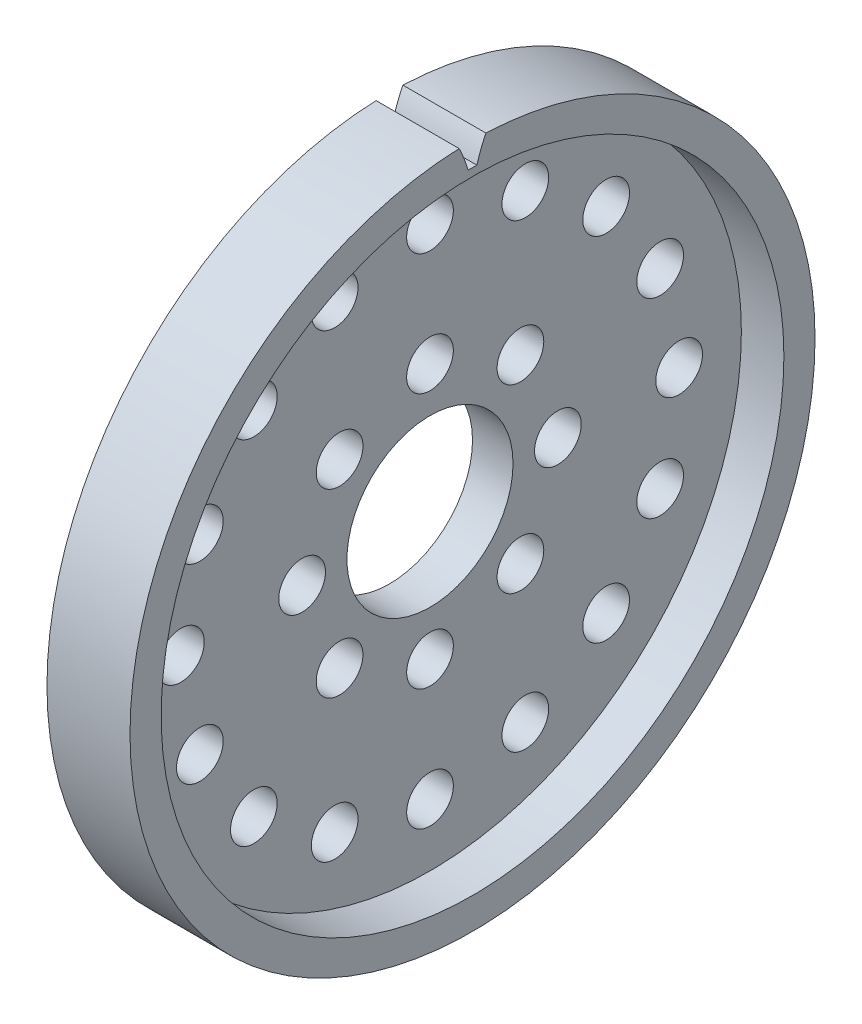
ISO-10303-21;
HEADER;
FILE_DESCRIPTION(('STEP AP214'),'2;1');
FILE_NAME('part.step','',(''),(''),'','','');
FILE_SCHEMA(('AUTOMOTIVE_DESIGN { 1 0 10303 214 1 1 1 1 }'));
ENDSEC;
DATA;
#1=APPLICATION_CONTEXT('core data for automotive mechanical design processes');
#2=APPLICATION_PROTOCOL_DEFINITION('international standard','automotive_design',2000,#1);
#3=PRODUCT_CONTEXT('',#1,'mechanical');
#4=PRODUCT('Part','Part','',(#3));
#5=PRODUCT_RELATED_PRODUCT_CATEGORY('part','',(#4));
#6=PRODUCT_DEFINITION_FORMATION('','',#4);
#7=PRODUCT_DEFINITION_CONTEXT('part definition',#1,'design');
#8=PRODUCT_DEFINITION('design','',#6,#7);
#9=PRODUCT_DEFINITION_SHAPE('','',#8);
#10=(LENGTH_UNIT() NAMED_UNIT(*) SI_UNIT(.MILLI.,.METRE.));
#11=(NAMED_UNIT(*) PLANE_ANGLE_UNIT() SI_UNIT($,.RADIAN.));
#12=(NAMED_UNIT(*) SI_UNIT($,.STERADIAN.) SOLID_ANGLE_UNIT());
#13=UNCERTAINTY_MEASURE_WITH_UNIT(LENGTH_MEASURE(1.E-05),#10,'distance_accuracy_value','');
#14=(GEOMETRIC_REPRESENTATION_CONTEXT(3) GLOBAL_UNCERTAINTY_ASSIGNED_CONTEXT((#13)) GLOBAL_UNIT_ASSIGNED_CONTEXT((#10,
#11,#12)) REPRESENTATION_CONTEXT('',''));
#15=CARTESIAN_POINT('',(0.,0.,0.));
#16=DIRECTION('',(0.,0.,1.));
#17=DIRECTION('',(1.,0.,0.));
#18=AXIS2_PLACEMENT_3D('',#15,#16,#17);
#19=CARTESIAN_POINT('',(50.8000508,0.,0.));
#20=DIRECTION('',(-1.,0.,0.));
#21=DIRECTION('',(0.,0.,1.));
#22=AXIS2_PLACEMENT_3D('',#19,#20,#21);
#23=CYLINDRICAL_SURFACE('',#22,6.35);
#24=CARTESIAN_POINT('',(0.,0.,0.));
#25=DIRECTION('',(1.,0.,0.));
#26=DIRECTION('',(0.,0.,-1.));
#27=AXIS2_PLACEMENT_3D('',#24,#25,#26);
#28=CIRCLE('',#27,6.35);
#29=CARTESIAN_POINT('',(0.,0.,-6.35));
#30=VERTEX_POINT('',#29);
#31=EDGE_CURVE('E99',#30,#30,#28,.F.);
#32=ORIENTED_EDGE('',*,*,#31,.T.);
#33=EDGE_LOOP('',(#32));
#34=FACE_BOUND('',#33,.T.);
#35=CARTESIAN_POINT('',(3.0988,0.,0.));
#36=DIRECTION('',(1.,0.,0.));
#37=DIRECTION('',(0.,0.,-1.));
#38=AXIS2_PLACEMENT_3D('',#35,#36,#37);
#39=CIRCLE('',#38,6.35);
#40=CARTESIAN_POINT('',(3.0988,0.,-6.35));
#41=VERTEX_POINT('',#40);
#42=EDGE_CURVE('E110',#41,#41,#39,.T.);
#43=ORIENTED_EDGE('',*,*,#42,.T.);
#44=EDGE_LOOP('',(#43));
#45=FACE_BOUND('',#44,.T.);
#46=ADVANCED_FACE('F33',(#34,#45),#23,.F.);
#47=CARTESIAN_POINT('',(6.35,0.,0.));
#48=DIRECTION('',(-1.,0.,0.));
#49=DIRECTION('',(0.,0.,1.));
#50=AXIS2_PLACEMENT_3D('',#47,#48,#49);
#51=PLANE('',#50);
#52=CARTESIAN_POINT('',(6.35,0.,0.));
#53=DIRECTION('',(1.,0.,0.));
#54=DIRECTION('',(0.,0.,-1.));
#55=AXIS2_PLACEMENT_3D('',#52,#53,#54);
#56=CIRCLE('',#55,23.8125);
#57=CARTESIAN_POINT('',(6.35,0.,-23.8125));
#58=VERTEX_POINT('',#57);
#59=EDGE_CURVE('E117',#58,#58,#56,.T.);
#60=ORIENTED_EDGE('',*,*,#59,.F.);
#61=EDGE_LOOP('',(#60));
#62=FACE_BOUND('',#61,.T.);
#63=CARTESIAN_POINT('',(6.35,21.6220977596711,-10.1081900010811));
#64=DIRECTION('',(-1.,0.,0.));
#65=DIRECTION('',(0.,0.,-1.));
#66=AXIS2_PLACEMENT_3D('',#63,#64,#65);
#67=CIRCLE('',#66,10.16);
#68=CARTESIAN_POINT('',(6.35,24.3944171391979,-0.333741410091427));
#69=VERTEX_POINT('',#68);
#70=CARTESIAN_POINT('',(6.35,26.1736965078502,-1.02476835306902));
#71=VERTEX_POINT('',#70);
#72=EDGE_CURVE('E55',#69,#71,#67,.T.);
#73=ORIENTED_EDGE('',*,*,#72,.F.);
#74=CARTESIAN_POINT('',(6.35,0.,0.));
#75=DIRECTION('',(-1.,0.,0.));
#76=DIRECTION('',(0.,0.,-1.));
#77=AXIS2_PLACEMENT_3D('',#74,#75,#76);
#78=CIRCLE('',#77,24.3967);
#79=CARTESIAN_POINT('',(6.35,24.3944171391979,0.33374141009143));
#80=VERTEX_POINT('',#79);
#81=EDGE_CURVE('E85',#80,#69,#78,.T.);
#82=ORIENTED_EDGE('',*,*,#81,.F.);
#83=CARTESIAN_POINT('',(6.35,21.6220977596711,10.1081900010811));
#84=DIRECTION('',(-1.,0.,0.));
#85=DIRECTION('',(0.,0.,-1.));
#86=AXIS2_PLACEMENT_3D('',#83,#84,#85);
#87=CIRCLE('',#86,10.16);
#88=CARTESIAN_POINT('',(6.35,26.1736965078502,1.02476835306902));
#89=VERTEX_POINT('',#88);
#90=EDGE_CURVE('E74',#89,#80,#87,.T.);
#91=ORIENTED_EDGE('',*,*,#90,.F.);
#92=CARTESIAN_POINT('',(6.35,0.,0.));
#93=DIRECTION('',(-1.,0.,0.));
#94=DIRECTION('',(0.,0.,1.));
#95=AXIS2_PLACEMENT_3D('',#92,#93,#94);
#96=CIRCLE('',#95,26.19375);
#97=EDGE_CURVE('E42',#71,#89,#96,.T.);
#98=ORIENTED_EDGE('',*,*,#97,.F.);
#99=EDGE_LOOP('',(#73,#82,#91,#98));
#100=FACE_BOUND('',#99,.T.);
#101=ADVANCED_FACE('F35',(#62,#100),#51,.F.);
#102=CARTESIAN_POINT('',(0.,0.,0.));
#103=DIRECTION('',(1.,0.,0.));
#104=DIRECTION('',(0.,0.,-1.));
#105=AXIS2_PLACEMENT_3D('',#102,#103,#104);
#106=PLANE('',#105);
#107=CARTESIAN_POINT('',(0.,9.779,0.));
#108=DIRECTION('',(1.,0.,0.));
#109=DIRECTION('',(0.,0.,-1.));
#110=AXIS2_PLACEMENT_3D('',#107,#108,#109);
#111=CIRCLE('',#110,1.786001);
#112=CARTESIAN_POINT('',(0.,9.779,-1.786001));
#113=VERTEX_POINT('',#112);
#114=EDGE_CURVE('E37',#113,#113,#111,.T.);
#115=ORIENTED_EDGE('',*,*,#114,.T.);
#116=EDGE_LOOP('',(#115));
#117=FACE_BOUND('',#116,.T.);
#118=CARTESIAN_POINT('',(0.,19.05,0.));
#119=DIRECTION('',(1.,0.,0.));
#120=DIRECTION('',(0.,0.,-1.));
#121=AXIS2_PLACEMENT_3D('',#118,#119,#120);
#122=CIRCLE('',#121,1.786001);
#123=CARTESIAN_POINT('',(0.,19.05,-1.786001));
#124=VERTEX_POINT('',#123);
#125=EDGE_CURVE('E202',#124,#124,#122,.T.);
#126=ORIENTED_EDGE('',*,*,#125,.T.);
#127=EDGE_LOOP('',(#126));
#128=FACE_BOUND('',#127,.T.);
#129=CARTESIAN_POINT('',(0.,17.59990509434,-7.29011938655498));
#130=DIRECTION('',(1.,0.,0.));
#131=DIRECTION('',(0.,0.,-1.));
#132=AXIS2_PLACEMENT_3D('',#129,#130,#131);
#133=CIRCLE('',#132,1.786001);
#134=CARTESIAN_POINT('',(0.,17.59990509434,-9.07612038655498));
#135=VERTEX_POINT('',#134);
#136=EDGE_CURVE('E199',#135,#135,#133,.T.);
#137=ORIENTED_EDGE('',*,*,#136,.T.);
#138=EDGE_LOOP('',(#137));
#139=FACE_BOUND('',#138,.T.);
#140=CARTESIAN_POINT('',(0.,13.4703841816037,-13.4703841816038));
#141=DIRECTION('',(1.,0.,0.));
#142=DIRECTION('',(0.,0.,-1.));
#143=AXIS2_PLACEMENT_3D('',#140,#141,#142);
#144=CIRCLE('',#143,1.786001);
#145=CARTESIAN_POINT('',(0.,13.4703841816037,-15.2563851816038));
#146=VERTEX_POINT('',#145);
#147=EDGE_CURVE('E195',#146,#146,#144,.T.);
#148=ORIENTED_EDGE('',*,*,#147,.T.);
#149=EDGE_LOOP('',(#148));
#150=FACE_BOUND('',#149,.T.);
#151=CARTESIAN_POINT('',(0.,7.29011938655491,-17.59990509434));
#152=DIRECTION('',(1.,0.,0.));
#153=DIRECTION('',(0.,0.,-1.));
#154=AXIS2_PLACEMENT_3D('',#151,#152,#153);
#155=CIRCLE('',#154,1.786001);
#156=CARTESIAN_POINT('',(0.,7.29011938655491,-19.38590609434));
#157=VERTEX_POINT('',#156);
#158=EDGE_CURVE('E191',#157,#157,#155,.T.);
#159=ORIENTED_EDGE('',*,*,#158,.T.);
#160=EDGE_LOOP('',(#159));
#161=FACE_BOUND('',#160,.T.);
#162=CARTESIAN_POINT('',(0.,0.,-19.05));
#163=DIRECTION('',(1.,0.,0.));
#164=DIRECTION('',(0.,0.,-1.));
#165=AXIS2_PLACEMENT_3D('',#162,#163,#164);
#166=CIRCLE('',#165,1.786001);
#167=CARTESIAN_POINT('',(0.,0.,-20.836001));
#168=VERTEX_POINT('',#167);
#169=EDGE_CURVE('E187',#168,#168,#166,.T.);
#170=ORIENTED_EDGE('',*,*,#169,.T.);
#171=EDGE_LOOP('',(#170));
#172=FACE_BOUND('',#171,.T.);
#173=CARTESIAN_POINT('',(0.,-7.29011938655504,-17.59990509434));
#174=DIRECTION('',(1.,0.,0.));
#175=DIRECTION('',(0.,0.,-1.));
#176=AXIS2_PLACEMENT_3D('',#173,#174,#175);
#177=CIRCLE('',#176,1.786001);
#178=CARTESIAN_POINT('',(0.,-7.29011938655504,-19.38590609434));
#179=VERTEX_POINT('',#178);
#180=EDGE_CURVE('E183',#179,#179,#177,.T.);
#181=ORIENTED_EDGE('',*,*,#180,.T.);
#182=EDGE_LOOP('',(#181));
#183=FACE_BOUND('',#182,.T.);
#184=CARTESIAN_POINT('',(0.,-13.4703841816036,-13.4703841816041));
#185=DIRECTION('',(1.,0.,0.));
#186=DIRECTION('',(0.,0.,-1.));
#187=AXIS2_PLACEMENT_3D('',#184,#185,#186);
#188=CIRCLE('',#187,1.786001);
#189=CARTESIAN_POINT('',(0.,-13.4703841816036,-15.2563851816041));
#190=VERTEX_POINT('',#189);
#191=EDGE_CURVE('E179',#190,#190,#188,.T.);
#192=ORIENTED_EDGE('',*,*,#191,.T.);
#193=EDGE_LOOP('',(#192));
#194=FACE_BOUND('',#193,.T.);
#195=CARTESIAN_POINT('',(0.,-17.5999050943399,-7.29011938655535));
#196=DIRECTION('',(1.,0.,0.));
#197=DIRECTION('',(0.,0.,-1.));
#198=AXIS2_PLACEMENT_3D('',#195,#196,#197);
#199=CIRCLE('',#198,1.786001);
#200=CARTESIAN_POINT('',(0.,-17.5999050943399,-9.07612038655535));
#201=VERTEX_POINT('',#200);
#202=EDGE_CURVE('E175',#201,#201,#199,.T.);
#203=ORIENTED_EDGE('',*,*,#202,.T.);
#204=EDGE_LOOP('',(#203));
#205=FACE_BOUND('',#204,.T.);
#206=CARTESIAN_POINT('',(0.,-19.05,-4.06721881351041E-13));
#207=DIRECTION('',(1.,0.,0.));
#208=DIRECTION('',(0.,0.,-1.));
#209=AXIS2_PLACEMENT_3D('',#206,#207,#208);
#210=CIRCLE('',#209,1.786001);
#211=CARTESIAN_POINT('',(0.,-19.05,-1.78600100000041));
#212=VERTEX_POINT('',#211);
#213=EDGE_CURVE('E171',#212,#212,#210,.T.);
#214=ORIENTED_EDGE('',*,*,#213,.T.);
#215=EDGE_LOOP('',(#214));
#216=FACE_BOUND('',#215,.T.);
#217=CARTESIAN_POINT('',(0.,-17.5999050943401,7.29011938655457));
#218=DIRECTION('',(1.,0.,0.));
#219=DIRECTION('',(0.,0.,-1.));
#220=AXIS2_PLACEMENT_3D('',#217,#218,#219);
#221=CIRCLE('',#220,1.786001);
#222=CARTESIAN_POINT('',(0.,-17.5999050943401,5.50411838655457));
#223=VERTEX_POINT('',#222);
#224=EDGE_CURVE('E167',#223,#223,#221,.T.);
#225=ORIENTED_EDGE('',*,*,#224,.T.);
#226=EDGE_LOOP('',(#225));
#227=FACE_BOUND('',#226,.T.);
#228=CARTESIAN_POINT('',(0.,-13.4703841816039,13.4703841816034));
#229=DIRECTION('',(1.,0.,0.));
#230=DIRECTION('',(0.,0.,-1.));
#231=AXIS2_PLACEMENT_3D('',#228,#229,#230);
#232=CIRCLE('',#231,1.786001);
#233=CARTESIAN_POINT('',(0.,-13.4703841816039,11.6843831816034));
#234=VERTEX_POINT('',#233);
#235=EDGE_CURVE('E163',#234,#234,#232,.T.);
#236=ORIENTED_EDGE('',*,*,#235,.T.);
#237=EDGE_LOOP('',(#236));
#238=FACE_BOUND('',#237,.T.);
#239=CARTESIAN_POINT('',(0.,-7.29011938655516,17.5999050943397));
#240=DIRECTION('',(1.,0.,0.));
#241=DIRECTION('',(0.,0.,-1.));
#242=AXIS2_PLACEMENT_3D('',#239,#240,#241);
#243=CIRCLE('',#242,1.786001);
#244=CARTESIAN_POINT('',(0.,-7.29011938655516,15.8139040943397));
#245=VERTEX_POINT('',#244);
#246=EDGE_CURVE('E159',#245,#245,#243,.T.);
#247=ORIENTED_EDGE('',*,*,#246,.T.);
#248=EDGE_LOOP('',(#247));
#249=FACE_BOUND('',#248,.T.);
#250=CARTESIAN_POINT('',(0.,-2.05693892827896E-13,19.0499999999998));
#251=DIRECTION('',(1.,0.,0.));
#252=DIRECTION('',(0.,0.,-1.));
#253=AXIS2_PLACEMENT_3D('',#250,#251,#252);
#254=CIRCLE('',#253,1.786001);
#255=CARTESIAN_POINT('',(0.,-2.05693892827896E-13,17.2639989999998));
#256=VERTEX_POINT('',#255);
#257=EDGE_CURVE('E155',#256,#256,#254,.T.);
#258=ORIENTED_EDGE('',*,*,#257,.T.);
#259=EDGE_LOOP('',(#258));
#260=FACE_BOUND('',#259,.T.);
#261=CARTESIAN_POINT('',(0.,7.29011938655515,17.5999050943399));
#262=DIRECTION('',(1.,0.,0.));
#263=DIRECTION('',(0.,0.,-1.));
#264=AXIS2_PLACEMENT_3D('',#261,#262,#263);
#265=CIRCLE('',#264,1.786001);
#266=CARTESIAN_POINT('',(0.,7.29011938655515,15.8139040943399));
#267=VERTEX_POINT('',#266);
#268=EDGE_CURVE('E151',#267,#267,#265,.T.);
#269=ORIENTED_EDGE('',*,*,#268,.T.);
#270=EDGE_LOOP('',(#269));
#271=FACE_BOUND('',#270,.T.);
#272=CARTESIAN_POINT('',(0.,13.4703841816039,13.4703841816036));
#273=DIRECTION('',(1.,0.,0.));
#274=DIRECTION('',(0.,0.,-1.));
#275=AXIS2_PLACEMENT_3D('',#272,#273,#274);
#276=CIRCLE('',#275,1.786001);
#277=CARTESIAN_POINT('',(0.,13.4703841816039,11.6843831816036));
#278=VERTEX_POINT('',#277);
#279=EDGE_CURVE('E147',#278,#278,#276,.T.);
#280=ORIENTED_EDGE('',*,*,#279,.T.);
#281=EDGE_LOOP('',(#280));
#282=FACE_BOUND('',#281,.T.);
#283=CARTESIAN_POINT('',(0.,17.5999050943401,7.29011938655472));
#284=DIRECTION('',(1.,0.,0.));
#285=DIRECTION('',(0.,0.,-1.));
#286=AXIS2_PLACEMENT_3D('',#283,#284,#285);
#287=CIRCLE('',#286,1.786001);
#288=CARTESIAN_POINT('',(0.,17.5999050943401,5.50411838655472));
#289=VERTEX_POINT('',#288);
#290=EDGE_CURVE('E143',#289,#289,#287,.T.);
#291=ORIENTED_EDGE('',*,*,#290,.T.);
#292=EDGE_LOOP('',(#291));
#293=FACE_BOUND('',#292,.T.);
#294=CARTESIAN_POINT('',(0.,6.91479721322324,-6.91479721322326));
#295=DIRECTION('',(1.,0.,0.));
#296=DIRECTION('',(0.,0.,-1.));
#297=AXIS2_PLACEMENT_3D('',#294,#295,#296);
#298=CIRCLE('',#297,1.786001);
#299=CARTESIAN_POINT('',(0.,6.91479721322324,-8.70079821322326));
#300=VERTEX_POINT('',#299);
#301=EDGE_CURVE('E139',#300,#300,#298,.T.);
#302=ORIENTED_EDGE('',*,*,#301,.T.);
#303=EDGE_LOOP('',(#302));
#304=FACE_BOUND('',#303,.T.);
#305=CARTESIAN_POINT('',(0.,0.,-9.779));
#306=DIRECTION('',(1.,0.,0.));
#307=DIRECTION('',(0.,0.,-1.));
#308=AXIS2_PLACEMENT_3D('',#305,#306,#307);
#309=CIRCLE('',#308,1.786001);
#310=CARTESIAN_POINT('',(0.,0.,-11.565001));
#311=VERTEX_POINT('',#310);
#312=EDGE_CURVE('E135',#311,#311,#309,.T.);
#313=ORIENTED_EDGE('',*,*,#312,.T.);
#314=EDGE_LOOP('',(#313));
#315=FACE_BOUND('',#314,.T.);
#316=CARTESIAN_POINT('',(0.,-6.91479721322328,-6.91479721322321));
#317=DIRECTION('',(1.,0.,0.));
#318=DIRECTION('',(0.,0.,-1.));
#319=AXIS2_PLACEMENT_3D('',#316,#317,#318);
#320=CIRCLE('',#319,1.786001);
#321=CARTESIAN_POINT('',(0.,-6.91479721322328,-8.70079821322321));
#322=VERTEX_POINT('',#321);
#323=EDGE_CURVE('E131',#322,#322,#320,.T.);
#324=ORIENTED_EDGE('',*,*,#323,.T.);
#325=EDGE_LOOP('',(#324));
#326=FACE_BOUND('',#325,.T.);
#327=CARTESIAN_POINT('',(0.,-9.779,0.));
#328=DIRECTION('',(1.,0.,0.));
#329=DIRECTION('',(0.,0.,-1.));
#330=AXIS2_PLACEMENT_3D('',#327,#328,#329);
#331=CIRCLE('',#330,1.786001);
#332=CARTESIAN_POINT('',(0.,-9.779,-1.78600099999993));
#333=VERTEX_POINT('',#332);
#334=EDGE_CURVE('E127',#333,#333,#331,.T.);
#335=ORIENTED_EDGE('',*,*,#334,.T.);
#336=EDGE_LOOP('',(#335));
#337=FACE_BOUND('',#336,.T.);
#338=CARTESIAN_POINT('',(0.,-6.91479721322319,6.91479721322331));
#339=DIRECTION('',(1.,0.,0.));
#340=DIRECTION('',(0.,0.,-1.));
#341=AXIS2_PLACEMENT_3D('',#338,#339,#340);
#342=CIRCLE('',#341,1.786001);
#343=CARTESIAN_POINT('',(0.,-6.91479721322319,5.12879621322331));
#344=VERTEX_POINT('',#343);
#345=EDGE_CURVE('E123',#344,#344,#342,.T.);
#346=ORIENTED_EDGE('',*,*,#345,.T.);
#347=EDGE_LOOP('',(#346));
#348=FACE_BOUND('',#347,.T.);
#349=CARTESIAN_POINT('',(0.,1.02429588037641E-13,9.779));
#350=DIRECTION('',(1.,0.,0.));
#351=DIRECTION('',(0.,0.,-1.));
#352=AXIS2_PLACEMENT_3D('',#349,#350,#351);
#353=CIRCLE('',#352,1.786001);
#354=CARTESIAN_POINT('',(0.,1.02429588037641E-13,7.992999));
#355=VERTEX_POINT('',#354);
#356=EDGE_CURVE('E119',#355,#355,#353,.T.);
#357=ORIENTED_EDGE('',*,*,#356,.T.);
#358=EDGE_LOOP('',(#357));
#359=FACE_BOUND('',#358,.T.);
#360=CARTESIAN_POINT('',(0.,6.91479721322333,6.91479721322316));
#361=DIRECTION('',(1.,0.,0.));
#362=DIRECTION('',(0.,0.,-1.));
#363=AXIS2_PLACEMENT_3D('',#360,#361,#362);
#364=CIRCLE('',#363,1.786001);
#365=CARTESIAN_POINT('',(0.,6.91479721322333,5.12879621322317));
#366=VERTEX_POINT('',#365);
#367=EDGE_CURVE('E114',#366,#366,#364,.T.);
#368=ORIENTED_EDGE('',*,*,#367,.T.);
#369=EDGE_LOOP('',(#368));
#370=FACE_BOUND('',#369,.T.);
#371=CARTESIAN_POINT('',(0.,21.6220977596711,-10.1081900010811));
#372=DIRECTION('',(-1.,0.,0.));
#373=DIRECTION('',(0.,0.,-1.));
#374=AXIS2_PLACEMENT_3D('',#371,#372,#373);
#375=CIRCLE('',#374,10.16);
#376=CARTESIAN_POINT('',(0.,24.3944171391979,-0.333741410091427));
#377=VERTEX_POINT('',#376);
#378=CARTESIAN_POINT('',(0.,26.1736965078502,-1.02476835306902));
#379=VERTEX_POINT('',#378);
#380=EDGE_CURVE('E50',#377,#379,#375,.T.);
#381=ORIENTED_EDGE('',*,*,#380,.T.);
#382=CARTESIAN_POINT('',(0.,0.,0.));
#383=DIRECTION('',(-1.,0.,0.));
#384=DIRECTION('',(0.,0.,1.));
#385=AXIS2_PLACEMENT_3D('',#382,#383,#384);
#386=CIRCLE('',#385,26.19375);
#387=CARTESIAN_POINT('',(0.,26.1736965078502,1.02476835306902));
#388=VERTEX_POINT('',#387);
#389=EDGE_CURVE('E104',#379,#388,#386,.T.);
#390=ORIENTED_EDGE('',*,*,#389,.T.);
#391=CARTESIAN_POINT('',(0.,21.6220977596711,10.1081900010811));
#392=DIRECTION('',(1.,0.,0.));
#393=DIRECTION('',(0.,0.,-1.));
#394=AXIS2_PLACEMENT_3D('',#391,#392,#393);
#395=CIRCLE('',#394,10.16);
#396=CARTESIAN_POINT('',(0.,24.3944171391979,0.33374141009143));
#397=VERTEX_POINT('',#396);
#398=EDGE_CURVE('E11',#397,#388,#395,.T.);
#399=ORIENTED_EDGE('',*,*,#398,.F.);
#400=CARTESIAN_POINT('',(0.,0.,0.));
#401=DIRECTION('',(-1.,0.,0.));
#402=DIRECTION('',(0.,0.,-1.));
#403=AXIS2_PLACEMENT_3D('',#400,#401,#402);
#404=CIRCLE('',#403,24.3967);
#405=EDGE_CURVE('E90',#397,#377,#404,.T.);
#406=ORIENTED_EDGE('',*,*,#405,.T.);
#407=EDGE_LOOP('',(#381,#390,#399,#406));
#408=FACE_BOUND('',#407,.T.);
#409=ORIENTED_EDGE('',*,*,#31,.F.);
#410=EDGE_LOOP('',(#409));
#411=FACE_BOUND('',#410,.T.);
#412=ADVANCED_FACE('F267',(#117,#128,#139,#150,#161,#172,#183,#194,#205,#216,#227,#238,#249,
#260,#271,#282,#293,#304,#315,#326,#337,#348,#359,#370,#408,#411),#106,.F.);
#413=CARTESIAN_POINT('',(-10.,0.,0.));
#414=DIRECTION('',(-1.,0.,0.));
#415=DIRECTION('',(0.,0.,1.));
#416=AXIS2_PLACEMENT_3D('',#413,#414,#415);
#417=CYLINDRICAL_SURFACE('',#416,26.19375);
#418=DIRECTION('',(-1.,0.,0.));
#419=VECTOR('',#418,1.);
#420=CARTESIAN_POINT('',(3.175,26.1736965078502,-1.02476835306902));
#421=LINE('',#420,#419);
#422=EDGE_CURVE('E102',#71,#379,#421,.T.);
#423=ORIENTED_EDGE('',*,*,#422,.F.);
#424=ORIENTED_EDGE('',*,*,#97,.T.);
#425=DIRECTION('',(-1.,0.,0.));
#426=VECTOR('',#425,1.);
#427=CARTESIAN_POINT('',(3.175,26.1736965078502,1.02476835306902));
#428=LINE('',#427,#426);
#429=EDGE_CURVE('E80',#388,#89,#428,.F.);
#430=ORIENTED_EDGE('',*,*,#429,.F.);
#431=ORIENTED_EDGE('',*,*,#389,.F.);
#432=EDGE_LOOP('',(#423,#424,#430,#431));
#433=FACE_BOUND('',#432,.T.);
#434=ADVANCED_FACE('F272',(#433),#417,.T.);
#435=CARTESIAN_POINT('',(6.35,21.6220977596711,-10.1081900010811));
#436=DIRECTION('',(-1.,0.,0.));
#437=DIRECTION('',(0.,0.,1.));
#438=AXIS2_PLACEMENT_3D('',#435,#436,#437);
#439=CYLINDRICAL_SURFACE('',#438,10.16);
#440=ORIENTED_EDGE('',*,*,#422,.T.);
#441=ORIENTED_EDGE('',*,*,#380,.F.);
#442=DIRECTION('',(-1.,0.,0.));
#443=VECTOR('',#442,1.);
#444=CARTESIAN_POINT('',(6.35,24.3944171391979,-0.333741410091427));
#445=LINE('',#444,#443);
#446=EDGE_CURVE('E92',#69,#377,#445,.T.);
#447=ORIENTED_EDGE('',*,*,#446,.F.);
#448=ORIENTED_EDGE('',*,*,#72,.T.);
#449=EDGE_LOOP('',(#440,#441,#447,#448));
#450=FACE_BOUND('',#449,.T.);
#451=ADVANCED_FACE('F287',(#450),#439,.T.);
#452=CARTESIAN_POINT('',(6.35,21.6220977596711,10.1081900010811));
#453=DIRECTION('',(-1.,0.,0.));
#454=DIRECTION('',(0.,0.,1.));
#455=AXIS2_PLACEMENT_3D('',#452,#453,#454);
#456=CYLINDRICAL_SURFACE('',#455,10.16);
#457=ORIENTED_EDGE('',*,*,#429,.T.);
#458=ORIENTED_EDGE('',*,*,#90,.T.);
#459=DIRECTION('',(-1.,0.,0.));
#460=VECTOR('',#459,1.);
#461=CARTESIAN_POINT('',(6.35,24.3944171391979,0.33374141009143));
#462=LINE('',#461,#460);
#463=EDGE_CURVE('E77',#80,#397,#462,.T.);
#464=ORIENTED_EDGE('',*,*,#463,.T.);
#465=ORIENTED_EDGE('',*,*,#398,.T.);
#466=EDGE_LOOP('',(#457,#458,#464,#465));
#467=FACE_BOUND('',#466,.T.);
#468=ADVANCED_FACE('F76',(#467),#456,.T.);
#469=CARTESIAN_POINT('',(6.35,0.,0.));
#470=DIRECTION('',(-1.,0.,0.));
#471=DIRECTION('',(0.,0.,1.));
#472=AXIS2_PLACEMENT_3D('',#469,#470,#471);
#473=CYLINDRICAL_SURFACE('',#472,24.3967);
#474=ORIENTED_EDGE('',*,*,#405,.F.);
#475=ORIENTED_EDGE('',*,*,#463,.F.);
#476=ORIENTED_EDGE('',*,*,#81,.T.);
#477=ORIENTED_EDGE('',*,*,#446,.T.);
#478=EDGE_LOOP('',(#474,#475,#476,#477));
#479=FACE_BOUND('',#478,.T.);
#480=ADVANCED_FACE('F88',(#479),#473,.T.);
#481=CARTESIAN_POINT('',(3.0988,0.,0.));
#482=DIRECTION('',(1.,0.,0.));
#483=DIRECTION('',(0.,0.,-1.));
#484=AXIS2_PLACEMENT_3D('',#481,#482,#483);
#485=CYLINDRICAL_SURFACE('',#484,23.8125);
#486=CARTESIAN_POINT('',(3.0988,0.,0.));
#487=DIRECTION('',(1.,0.,0.));
#488=DIRECTION('',(0.,0.,-1.));
#489=AXIS2_PLACEMENT_3D('',#486,#487,#488);
#490=CIRCLE('',#489,23.8125);
#491=CARTESIAN_POINT('',(3.0988,0.,-23.8125));
#492=VERTEX_POINT('',#491);
#493=EDGE_CURVE('E113',#492,#492,#490,.T.);
#494=ORIENTED_EDGE('',*,*,#493,.F.);
#495=EDGE_LOOP('',(#494));
#496=FACE_BOUND('',#495,.T.);
#497=ORIENTED_EDGE('',*,*,#59,.T.);
#498=EDGE_LOOP('',(#497));
#499=FACE_BOUND('',#498,.T.);
#500=ADVANCED_FACE('F264',(#496,#499),#485,.F.);
#501=CARTESIAN_POINT('',(3.0988,0.,0.));
#502=DIRECTION('',(1.,0.,0.));
#503=DIRECTION('',(0.,0.,-1.));
#504=AXIS2_PLACEMENT_3D('',#501,#502,#503);
#505=PLANE('',#504);
#506=CARTESIAN_POINT('',(3.0988,9.779,0.));
#507=DIRECTION('',(1.,0.,0.));
#508=DIRECTION('',(0.,0.,-1.));
#509=AXIS2_PLACEMENT_3D('',#506,#507,#508);
#510=CIRCLE('',#509,1.786001);
#511=CARTESIAN_POINT('',(3.0988,9.779,-1.786001));
#512=VERTEX_POINT('',#511);
#513=EDGE_CURVE('E214',#512,#512,#510,.T.);
#514=ORIENTED_EDGE('',*,*,#513,.F.);
#515=EDGE_LOOP('',(#514));
#516=FACE_BOUND('',#515,.T.);
#517=CARTESIAN_POINT('',(3.0988,19.05,0.));
#518=DIRECTION('',(1.,0.,0.));
#519=DIRECTION('',(0.,0.,-1.));
#520=AXIS2_PLACEMENT_3D('',#517,#518,#519);
#521=CIRCLE('',#520,1.786001);
#522=CARTESIAN_POINT('',(3.0988,19.05,-1.786001));
#523=VERTEX_POINT('',#522);
#524=EDGE_CURVE('E204',#523,#523,#521,.T.);
#525=ORIENTED_EDGE('',*,*,#524,.F.);
#526=EDGE_LOOP('',(#525));
#527=FACE_BOUND('',#526,.T.);
#528=CARTESIAN_POINT('',(3.0988,17.59990509434,-7.29011938655498));
#529=DIRECTION('',(1.,0.,0.));
#530=DIRECTION('',(0.,0.,-1.));
#531=AXIS2_PLACEMENT_3D('',#528,#529,#530);
#532=CIRCLE('',#531,1.786001);
#533=CARTESIAN_POINT('',(3.0988,17.59990509434,-9.07612038655498));
#534=VERTEX_POINT('',#533);
#535=EDGE_CURVE('E201',#534,#534,#532,.T.);
#536=ORIENTED_EDGE('',*,*,#535,.F.);
#537=EDGE_LOOP('',(#536));
#538=FACE_BOUND('',#537,.T.);
#539=CARTESIAN_POINT('',(3.0988,13.4703841816037,-13.4703841816038));
#540=DIRECTION('',(1.,0.,0.));
#541=DIRECTION('',(0.,0.,-1.));
#542=AXIS2_PLACEMENT_3D('',#539,#540,#541);
#543=CIRCLE('',#542,1.786001);
#544=CARTESIAN_POINT('',(3.0988,13.4703841816037,-15.2563851816038));
#545=VERTEX_POINT('',#544);
#546=EDGE_CURVE('E198',#545,#545,#543,.T.);
#547=ORIENTED_EDGE('',*,*,#546,.F.);
#548=EDGE_LOOP('',(#547));
#549=FACE_BOUND('',#548,.T.);
#550=CARTESIAN_POINT('',(3.0988,7.29011938655491,-17.59990509434));
#551=DIRECTION('',(1.,0.,0.));
#552=DIRECTION('',(0.,0.,-1.));
#553=AXIS2_PLACEMENT_3D('',#550,#551,#552);
#554=CIRCLE('',#553,1.786001);
#555=CARTESIAN_POINT('',(3.0988,7.29011938655491,-19.38590609434));
#556=VERTEX_POINT('',#555);
#557=EDGE_CURVE('E194',#556,#556,#554,.T.);
#558=ORIENTED_EDGE('',*,*,#557,.F.);
#559=EDGE_LOOP('',(#558));
#560=FACE_BOUND('',#559,.T.);
#561=CARTESIAN_POINT('',(3.0988,0.,-19.05));
#562=DIRECTION('',(1.,0.,0.));
#563=DIRECTION('',(0.,0.,-1.));
#564=AXIS2_PLACEMENT_3D('',#561,#562,#563);
#565=CIRCLE('',#564,1.786001);
#566=CARTESIAN_POINT('',(3.0988,0.,-20.836001));
#567=VERTEX_POINT('',#566);
#568=EDGE_CURVE('E190',#567,#567,#565,.T.);
#569=ORIENTED_EDGE('',*,*,#568,.F.);
#570=EDGE_LOOP('',(#569));
#571=FACE_BOUND('',#570,.T.);
#572=CARTESIAN_POINT('',(3.0988,-7.29011938655504,-17.59990509434));
#573=DIRECTION('',(1.,0.,0.));
#574=DIRECTION('',(0.,0.,-1.));
#575=AXIS2_PLACEMENT_3D('',#572,#573,#574);
#576=CIRCLE('',#575,1.786001);
#577=CARTESIAN_POINT('',(3.0988,-7.29011938655504,-19.38590609434));
#578=VERTEX_POINT('',#577);
#579=EDGE_CURVE('E186',#578,#578,#576,.T.);
#580=ORIENTED_EDGE('',*,*,#579,.F.);
#581=EDGE_LOOP('',(#580));
#582=FACE_BOUND('',#581,.T.);
#583=CARTESIAN_POINT('',(3.0988,-13.4703841816036,-13.4703841816041));
#584=DIRECTION('',(1.,0.,0.));
#585=DIRECTION('',(0.,0.,-1.));
#586=AXIS2_PLACEMENT_3D('',#583,#584,#585);
#587=CIRCLE('',#586,1.786001);
#588=CARTESIAN_POINT('',(3.0988,-13.4703841816036,-15.2563851816041));
#589=VERTEX_POINT('',#588);
#590=EDGE_CURVE('E182',#589,#589,#587,.T.);
#591=ORIENTED_EDGE('',*,*,#590,.F.);
#592=EDGE_LOOP('',(#591));
#593=FACE_BOUND('',#592,.T.);
#594=CARTESIAN_POINT('',(3.0988,-17.5999050943399,-7.29011938655535));
#595=DIRECTION('',(1.,0.,0.));
#596=DIRECTION('',(0.,0.,-1.));
#597=AXIS2_PLACEMENT_3D('',#594,#595,#596);
#598=CIRCLE('',#597,1.786001);
#599=CARTESIAN_POINT('',(3.0988,-17.5999050943399,-9.07612038655535));
#600=VERTEX_POINT('',#599);
#601=EDGE_CURVE('E178',#600,#600,#598,.T.);
#602=ORIENTED_EDGE('',*,*,#601,.F.);
#603=EDGE_LOOP('',(#602));
#604=FACE_BOUND('',#603,.T.);
#605=CARTESIAN_POINT('',(3.0988,-19.05,-4.06721881351041E-13));
#606=DIRECTION('',(1.,0.,0.));
#607=DIRECTION('',(0.,0.,-1.));
#608=AXIS2_PLACEMENT_3D('',#605,#606,#607);
#609=CIRCLE('',#608,1.786001);
#610=CARTESIAN_POINT('',(3.0988,-19.05,-1.78600100000041));
#611=VERTEX_POINT('',#610);
#612=EDGE_CURVE('E174',#611,#611,#609,.T.);
#613=ORIENTED_EDGE('',*,*,#612,.F.);
#614=EDGE_LOOP('',(#613));
#615=FACE_BOUND('',#614,.T.);
#616=CARTESIAN_POINT('',(3.0988,-17.5999050943401,7.29011938655457));
#617=DIRECTION('',(1.,0.,0.));
#618=DIRECTION('',(0.,0.,-1.));
#619=AXIS2_PLACEMENT_3D('',#616,#617,#618);
#620=CIRCLE('',#619,1.786001);
#621=CARTESIAN_POINT('',(3.0988,-17.5999050943401,5.50411838655457));
#622=VERTEX_POINT('',#621);
#623=EDGE_CURVE('E170',#622,#622,#620,.T.);
#624=ORIENTED_EDGE('',*,*,#623,.F.);
#625=EDGE_LOOP('',(#624));
#626=FACE_BOUND('',#625,.T.);
#627=CARTESIAN_POINT('',(3.0988,-13.4703841816039,13.4703841816034));
#628=DIRECTION('',(1.,0.,0.));
#629=DIRECTION('',(0.,0.,-1.));
#630=AXIS2_PLACEMENT_3D('',#627,#628,#629);
#631=CIRCLE('',#630,1.786001);
#632=CARTESIAN_POINT('',(3.0988,-13.4703841816039,11.6843831816034));
#633=VERTEX_POINT('',#632);
#634=EDGE_CURVE('E166',#633,#633,#631,.T.);
#635=ORIENTED_EDGE('',*,*,#634,.F.);
#636=EDGE_LOOP('',(#635));
#637=FACE_BOUND('',#636,.T.);
#638=CARTESIAN_POINT('',(3.0988,-7.29011938655516,17.5999050943397));
#639=DIRECTION('',(1.,0.,0.));
#640=DIRECTION('',(0.,0.,-1.));
#641=AXIS2_PLACEMENT_3D('',#638,#639,#640);
#642=CIRCLE('',#641,1.786001);
#643=CARTESIAN_POINT('',(3.0988,-7.29011938655516,15.8139040943397));
#644=VERTEX_POINT('',#643);
#645=EDGE_CURVE('E162',#644,#644,#642,.T.);
#646=ORIENTED_EDGE('',*,*,#645,.F.);
#647=EDGE_LOOP('',(#646));
#648=FACE_BOUND('',#647,.T.);
#649=CARTESIAN_POINT('',(3.0988,-2.05693892827896E-13,19.0499999999998));
#650=DIRECTION('',(1.,0.,0.));
#651=DIRECTION('',(0.,0.,-1.));
#652=AXIS2_PLACEMENT_3D('',#649,#650,#651);
#653=CIRCLE('',#652,1.786001);
#654=CARTESIAN_POINT('',(3.0988,-2.05693892827896E-13,17.2639989999998));
#655=VERTEX_POINT('',#654);
#656=EDGE_CURVE('E158',#655,#655,#653,.T.);
#657=ORIENTED_EDGE('',*,*,#656,.F.);
#658=EDGE_LOOP('',(#657));
#659=FACE_BOUND('',#658,.T.);
#660=CARTESIAN_POINT('',(3.0988,7.29011938655515,17.5999050943399));
#661=DIRECTION('',(1.,0.,0.));
#662=DIRECTION('',(0.,0.,-1.));
#663=AXIS2_PLACEMENT_3D('',#660,#661,#662);
#664=CIRCLE('',#663,1.786001);
#665=CARTESIAN_POINT('',(3.0988,7.29011938655515,15.8139040943399));
#666=VERTEX_POINT('',#665);
#667=EDGE_CURVE('E154',#666,#666,#664,.T.);
#668=ORIENTED_EDGE('',*,*,#667,.F.);
#669=EDGE_LOOP('',(#668));
#670=FACE_BOUND('',#669,.T.);
#671=CARTESIAN_POINT('',(3.0988,13.4703841816039,13.4703841816036));
#672=DIRECTION('',(1.,0.,0.));
#673=DIRECTION('',(0.,0.,-1.));
#674=AXIS2_PLACEMENT_3D('',#671,#672,#673);
#675=CIRCLE('',#674,1.786001);
#676=CARTESIAN_POINT('',(3.0988,13.4703841816039,11.6843831816036));
#677=VERTEX_POINT('',#676);
#678=EDGE_CURVE('E150',#677,#677,#675,.T.);
#679=ORIENTED_EDGE('',*,*,#678,.F.);
#680=EDGE_LOOP('',(#679));
#681=FACE_BOUND('',#680,.T.);
#682=CARTESIAN_POINT('',(3.0988,17.5999050943401,7.29011938655472));
#683=DIRECTION('',(1.,0.,0.));
#684=DIRECTION('',(0.,0.,-1.));
#685=AXIS2_PLACEMENT_3D('',#682,#683,#684);
#686=CIRCLE('',#685,1.786001);
#687=CARTESIAN_POINT('',(3.0988,17.5999050943401,5.50411838655472));
#688=VERTEX_POINT('',#687);
#689=EDGE_CURVE('E146',#688,#688,#686,.T.);
#690=ORIENTED_EDGE('',*,*,#689,.F.);
#691=EDGE_LOOP('',(#690));
#692=FACE_BOUND('',#691,.T.);
#693=CARTESIAN_POINT('',(3.0988,6.91479721322324,-6.91479721322326));
#694=DIRECTION('',(1.,0.,0.));
#695=DIRECTION('',(0.,0.,-1.));
#696=AXIS2_PLACEMENT_3D('',#693,#694,#695);
#697=CIRCLE('',#696,1.786001);
#698=CARTESIAN_POINT('',(3.0988,6.91479721322324,-8.70079821322326));
#699=VERTEX_POINT('',#698);
#700=EDGE_CURVE('E142',#699,#699,#697,.T.);
#701=ORIENTED_EDGE('',*,*,#700,.F.);
#702=EDGE_LOOP('',(#701));
#703=FACE_BOUND('',#702,.T.);
#704=CARTESIAN_POINT('',(3.0988,0.,-9.779));
#705=DIRECTION('',(1.,0.,0.));
#706=DIRECTION('',(0.,0.,-1.));
#707=AXIS2_PLACEMENT_3D('',#704,#705,#706);
#708=CIRCLE('',#707,1.786001);
#709=CARTESIAN_POINT('',(3.0988,0.,-11.565001));
#710=VERTEX_POINT('',#709);
#711=EDGE_CURVE('E138',#710,#710,#708,.T.);
#712=ORIENTED_EDGE('',*,*,#711,.F.);
#713=EDGE_LOOP('',(#712));
#714=FACE_BOUND('',#713,.T.);
#715=CARTESIAN_POINT('',(3.0988,-6.91479721322328,-6.91479721322321));
#716=DIRECTION('',(1.,0.,0.));
#717=DIRECTION('',(0.,0.,-1.));
#718=AXIS2_PLACEMENT_3D('',#715,#716,#717);
#719=CIRCLE('',#718,1.786001);
#720=CARTESIAN_POINT('',(3.0988,-6.91479721322328,-8.70079821322321));
#721=VERTEX_POINT('',#720);
#722=EDGE_CURVE('E134',#721,#721,#719,.T.);
#723=ORIENTED_EDGE('',*,*,#722,.F.);
#724=EDGE_LOOP('',(#723));
#725=FACE_BOUND('',#724,.T.);
#726=CARTESIAN_POINT('',(3.0988,-9.779,0.));
#727=DIRECTION('',(1.,0.,0.));
#728=DIRECTION('',(0.,0.,-1.));
#729=AXIS2_PLACEMENT_3D('',#726,#727,#728);
#730=CIRCLE('',#729,1.786001);
#731=CARTESIAN_POINT('',(3.0988,-9.779,-1.78600099999993));
#732=VERTEX_POINT('',#731);
#733=EDGE_CURVE('E130',#732,#732,#730,.T.);
#734=ORIENTED_EDGE('',*,*,#733,.F.);
#735=EDGE_LOOP('',(#734));
#736=FACE_BOUND('',#735,.T.);
#737=CARTESIAN_POINT('',(3.0988,-6.91479721322319,6.91479721322331));
#738=DIRECTION('',(1.,0.,0.));
#739=DIRECTION('',(0.,0.,-1.));
#740=AXIS2_PLACEMENT_3D('',#737,#738,#739);
#741=CIRCLE('',#740,1.786001);
#742=CARTESIAN_POINT('',(3.0988,-6.91479721322319,5.12879621322331));
#743=VERTEX_POINT('',#742);
#744=EDGE_CURVE('E126',#743,#743,#741,.T.);
#745=ORIENTED_EDGE('',*,*,#744,.F.);
#746=EDGE_LOOP('',(#745));
#747=FACE_BOUND('',#746,.T.);
#748=CARTESIAN_POINT('',(3.0988,1.02429588037641E-13,9.779));
#749=DIRECTION('',(1.,0.,0.));
#750=DIRECTION('',(0.,0.,-1.));
#751=AXIS2_PLACEMENT_3D('',#748,#749,#750);
#752=CIRCLE('',#751,1.786001);
#753=CARTESIAN_POINT('',(3.0988,1.02429588037641E-13,7.992999));
#754=VERTEX_POINT('',#753);
#755=EDGE_CURVE('E122',#754,#754,#752,.T.);
#756=ORIENTED_EDGE('',*,*,#755,.F.);
#757=EDGE_LOOP('',(#756));
#758=FACE_BOUND('',#757,.T.);
#759=CARTESIAN_POINT('',(3.0988,6.91479721322333,6.91479721322316));
#760=DIRECTION('',(1.,0.,0.));
#761=DIRECTION('',(0.,0.,-1.));
#762=AXIS2_PLACEMENT_3D('',#759,#760,#761);
#763=CIRCLE('',#762,1.786001);
#764=CARTESIAN_POINT('',(3.0988,6.91479721322333,5.12879621322317));
#765=VERTEX_POINT('',#764);
#766=EDGE_CURVE('E118',#765,#765,#763,.T.);
#767=ORIENTED_EDGE('',*,*,#766,.F.);
#768=EDGE_LOOP('',(#767));
#769=FACE_BOUND('',#768,.T.);
#770=ORIENTED_EDGE('',*,*,#42,.F.);
#771=EDGE_LOOP('',(#770));
#772=FACE_BOUND('',#771,.T.);
#773=ORIENTED_EDGE('',*,*,#493,.T.);
#774=EDGE_LOOP('',(#773));
#775=FACE_BOUND('',#774,.T.);
#776=ADVANCED_FACE('F317',(#516,#527,#538,#549,#560,#571,#582,#593,#604,#615,#626,#637,#648,
#659,#670,#681,#692,#703,#714,#725,#736,#747,#758,#769,#772,#775),#505,.T.);
#777=CARTESIAN_POINT('',(3.0988,6.91479721322333,6.91479721322316));
#778=DIRECTION('',(1.,0.,0.));
#779=DIRECTION('',(0.,0.,-1.));
#780=AXIS2_PLACEMENT_3D('',#777,#778,#779);
#781=CYLINDRICAL_SURFACE('',#780,1.786001);
#782=ORIENTED_EDGE('',*,*,#766,.T.);
#783=EDGE_LOOP('',(#782));
#784=FACE_BOUND('',#783,.T.);
#785=ORIENTED_EDGE('',*,*,#367,.F.);
#786=EDGE_LOOP('',(#785));
#787=FACE_BOUND('',#786,.T.);
#788=ADVANCED_FACE('F324',(#784,#787),#781,.F.);
#789=CARTESIAN_POINT('',(3.0988,1.02429588037641E-13,9.779));
#790=DIRECTION('',(1.,0.,0.));
#791=DIRECTION('',(0.,0.,-1.));
#792=AXIS2_PLACEMENT_3D('',#789,#790,#791);
#793=CYLINDRICAL_SURFACE('',#792,1.786001);
#794=ORIENTED_EDGE('',*,*,#755,.T.);
#795=EDGE_LOOP('',(#794));
#796=FACE_BOUND('',#795,.T.);
#797=ORIENTED_EDGE('',*,*,#356,.F.);
#798=EDGE_LOOP('',(#797));
#799=FACE_BOUND('',#798,.T.);
#800=ADVANCED_FACE('F331',(#796,#799),#793,.F.);
#801=CARTESIAN_POINT('',(3.0988,-6.91479721322319,6.91479721322331));
#802=DIRECTION('',(1.,0.,0.));
#803=DIRECTION('',(0.,0.,-1.));
#804=AXIS2_PLACEMENT_3D('',#801,#802,#803);
#805=CYLINDRICAL_SURFACE('',#804,1.786001);
#806=ORIENTED_EDGE('',*,*,#744,.T.);
#807=EDGE_LOOP('',(#806));
#808=FACE_BOUND('',#807,.T.);
#809=ORIENTED_EDGE('',*,*,#345,.F.);
#810=EDGE_LOOP('',(#809));
#811=FACE_BOUND('',#810,.T.);
#812=ADVANCED_FACE('F339',(#808,#811),#805,.F.);
#813=CARTESIAN_POINT('',(3.0988,-9.779,0.));
#814=DIRECTION('',(1.,0.,0.));
#815=DIRECTION('',(0.,0.,-1.));
#816=AXIS2_PLACEMENT_3D('',#813,#814,#815);
#817=CYLINDRICAL_SURFACE('',#816,1.786001);
#818=ORIENTED_EDGE('',*,*,#733,.T.);
#819=EDGE_LOOP('',(#818));
#820=FACE_BOUND('',#819,.T.);
#821=ORIENTED_EDGE('',*,*,#334,.F.);
#822=EDGE_LOOP('',(#821));
#823=FACE_BOUND('',#822,.T.);
#824=ADVANCED_FACE('F347',(#820,#823),#817,.F.);
#825=CARTESIAN_POINT('',(3.0988,-6.91479721322328,-6.91479721322321));
#826=DIRECTION('',(1.,0.,0.));
#827=DIRECTION('',(0.,0.,-1.));
#828=AXIS2_PLACEMENT_3D('',#825,#826,#827);
#829=CYLINDRICAL_SURFACE('',#828,1.786001);
#830=ORIENTED_EDGE('',*,*,#722,.T.);
#831=EDGE_LOOP('',(#830));
#832=FACE_BOUND('',#831,.T.);
#833=ORIENTED_EDGE('',*,*,#323,.F.);
#834=EDGE_LOOP('',(#833));
#835=FACE_BOUND('',#834,.T.);
#836=ADVANCED_FACE('F355',(#832,#835),#829,.F.);
#837=CARTESIAN_POINT('',(3.0988,0.,-9.779));
#838=DIRECTION('',(1.,0.,0.));
#839=DIRECTION('',(0.,0.,-1.));
#840=AXIS2_PLACEMENT_3D('',#837,#838,#839);
#841=CYLINDRICAL_SURFACE('',#840,1.786001);
#842=ORIENTED_EDGE('',*,*,#711,.T.);
#843=EDGE_LOOP('',(#842));
#844=FACE_BOUND('',#843,.T.);
#845=ORIENTED_EDGE('',*,*,#312,.F.);
#846=EDGE_LOOP('',(#845));
#847=FACE_BOUND('',#846,.T.);
#848=ADVANCED_FACE('F363',(#844,#847),#841,.F.);
#849=CARTESIAN_POINT('',(3.0988,6.91479721322324,-6.91479721322326));
#850=DIRECTION('',(1.,0.,0.));
#851=DIRECTION('',(0.,0.,-1.));
#852=AXIS2_PLACEMENT_3D('',#849,#850,#851);
#853=CYLINDRICAL_SURFACE('',#852,1.786001);
#854=ORIENTED_EDGE('',*,*,#700,.T.);
#855=EDGE_LOOP('',(#854));
#856=FACE_BOUND('',#855,.T.);
#857=ORIENTED_EDGE('',*,*,#301,.F.);
#858=EDGE_LOOP('',(#857));
#859=FACE_BOUND('',#858,.T.);
#860=ADVANCED_FACE('F371',(#856,#859),#853,.F.);
#861=CARTESIAN_POINT('',(3.0988,17.5999050943401,7.29011938655472));
#862=DIRECTION('',(1.,0.,0.));
#863=DIRECTION('',(0.,0.,-1.));
#864=AXIS2_PLACEMENT_3D('',#861,#862,#863);
#865=CYLINDRICAL_SURFACE('',#864,1.786001);
#866=ORIENTED_EDGE('',*,*,#689,.T.);
#867=EDGE_LOOP('',(#866));
#868=FACE_BOUND('',#867,.T.);
#869=ORIENTED_EDGE('',*,*,#290,.F.);
#870=EDGE_LOOP('',(#869));
#871=FACE_BOUND('',#870,.T.);
#872=ADVANCED_FACE('F379',(#868,#871),#865,.F.);
#873=CARTESIAN_POINT('',(3.0988,13.4703841816039,13.4703841816036));
#874=DIRECTION('',(1.,0.,0.));
#875=DIRECTION('',(0.,0.,-1.));
#876=AXIS2_PLACEMENT_3D('',#873,#874,#875);
#877=CYLINDRICAL_SURFACE('',#876,1.786001);
#878=ORIENTED_EDGE('',*,*,#678,.T.);
#879=EDGE_LOOP('',(#878));
#880=FACE_BOUND('',#879,.T.);
#881=ORIENTED_EDGE('',*,*,#279,.F.);
#882=EDGE_LOOP('',(#881));
#883=FACE_BOUND('',#882,.T.);
#884=ADVANCED_FACE('F387',(#880,#883),#877,.F.);
#885=CARTESIAN_POINT('',(3.0988,7.29011938655515,17.5999050943399));
#886=DIRECTION('',(1.,0.,0.));
#887=DIRECTION('',(0.,0.,-1.));
#888=AXIS2_PLACEMENT_3D('',#885,#886,#887);
#889=CYLINDRICAL_SURFACE('',#888,1.786001);
#890=ORIENTED_EDGE('',*,*,#667,.T.);
#891=EDGE_LOOP('',(#890));
#892=FACE_BOUND('',#891,.T.);
#893=ORIENTED_EDGE('',*,*,#268,.F.);
#894=EDGE_LOOP('',(#893));
#895=FACE_BOUND('',#894,.T.);
#896=ADVANCED_FACE('F395',(#892,#895),#889,.F.);
#897=CARTESIAN_POINT('',(3.0988,-2.05693892827896E-13,19.0499999999998));
#898=DIRECTION('',(1.,0.,0.));
#899=DIRECTION('',(0.,0.,-1.));
#900=AXIS2_PLACEMENT_3D('',#897,#898,#899);
#901=CYLINDRICAL_SURFACE('',#900,1.786001);
#902=ORIENTED_EDGE('',*,*,#656,.T.);
#903=EDGE_LOOP('',(#902));
#904=FACE_BOUND('',#903,.T.);
#905=ORIENTED_EDGE('',*,*,#257,.F.);
#906=EDGE_LOOP('',(#905));
#907=FACE_BOUND('',#906,.T.);
#908=ADVANCED_FACE('F403',(#904,#907),#901,.F.);
#909=CARTESIAN_POINT('',(3.0988,-7.29011938655516,17.5999050943397));
#910=DIRECTION('',(1.,0.,0.));
#911=DIRECTION('',(0.,0.,-1.));
#912=AXIS2_PLACEMENT_3D('',#909,#910,#911);
#913=CYLINDRICAL_SURFACE('',#912,1.786001);
#914=ORIENTED_EDGE('',*,*,#645,.T.);
#915=EDGE_LOOP('',(#914));
#916=FACE_BOUND('',#915,.T.);
#917=ORIENTED_EDGE('',*,*,#246,.F.);
#918=EDGE_LOOP('',(#917));
#919=FACE_BOUND('',#918,.T.);
#920=ADVANCED_FACE('F411',(#916,#919),#913,.F.);
#921=CARTESIAN_POINT('',(3.0988,-13.4703841816039,13.4703841816034));
#922=DIRECTION('',(1.,0.,0.));
#923=DIRECTION('',(0.,0.,-1.));
#924=AXIS2_PLACEMENT_3D('',#921,#922,#923);
#925=CYLINDRICAL_SURFACE('',#924,1.786001);
#926=ORIENTED_EDGE('',*,*,#634,.T.);
#927=EDGE_LOOP('',(#926));
#928=FACE_BOUND('',#927,.T.);
#929=ORIENTED_EDGE('',*,*,#235,.F.);
#930=EDGE_LOOP('',(#929));
#931=FACE_BOUND('',#930,.T.);
#932=ADVANCED_FACE('F419',(#928,#931),#925,.F.);
#933=CARTESIAN_POINT('',(3.0988,-17.5999050943401,7.29011938655457));
#934=DIRECTION('',(1.,0.,0.));
#935=DIRECTION('',(0.,0.,-1.));
#936=AXIS2_PLACEMENT_3D('',#933,#934,#935);
#937=CYLINDRICAL_SURFACE('',#936,1.786001);
#938=ORIENTED_EDGE('',*,*,#623,.T.);
#939=EDGE_LOOP('',(#938));
#940=FACE_BOUND('',#939,.T.);
#941=ORIENTED_EDGE('',*,*,#224,.F.);
#942=EDGE_LOOP('',(#941));
#943=FACE_BOUND('',#942,.T.);
#944=ADVANCED_FACE('F427',(#940,#943),#937,.F.);
#945=CARTESIAN_POINT('',(3.0988,-19.05,-4.06721881351041E-13));
#946=DIRECTION('',(1.,0.,0.));
#947=DIRECTION('',(0.,0.,-1.));
#948=AXIS2_PLACEMENT_3D('',#945,#946,#947);
#949=CYLINDRICAL_SURFACE('',#948,1.786001);
#950=ORIENTED_EDGE('',*,*,#612,.T.);
#951=EDGE_LOOP('',(#950));
#952=FACE_BOUND('',#951,.T.);
#953=ORIENTED_EDGE('',*,*,#213,.F.);
#954=EDGE_LOOP('',(#953));
#955=FACE_BOUND('',#954,.T.);
#956=ADVANCED_FACE('F435',(#952,#955),#949,.F.);
#957=CARTESIAN_POINT('',(3.0988,-17.5999050943399,-7.29011938655535));
#958=DIRECTION('',(1.,0.,0.));
#959=DIRECTION('',(0.,0.,-1.));
#960=AXIS2_PLACEMENT_3D('',#957,#958,#959);
#961=CYLINDRICAL_SURFACE('',#960,1.786001);
#962=ORIENTED_EDGE('',*,*,#601,.T.);
#963=EDGE_LOOP('',(#962));
#964=FACE_BOUND('',#963,.T.);
#965=ORIENTED_EDGE('',*,*,#202,.F.);
#966=EDGE_LOOP('',(#965));
#967=FACE_BOUND('',#966,.T.);
#968=ADVANCED_FACE('F443',(#964,#967),#961,.F.);
#969=CARTESIAN_POINT('',(3.0988,-13.4703841816036,-13.4703841816041));
#970=DIRECTION('',(1.,0.,0.));
#971=DIRECTION('',(0.,0.,-1.));
#972=AXIS2_PLACEMENT_3D('',#969,#970,#971);
#973=CYLINDRICAL_SURFACE('',#972,1.786001);
#974=ORIENTED_EDGE('',*,*,#590,.T.);
#975=EDGE_LOOP('',(#974));
#976=FACE_BOUND('',#975,.T.);
#977=ORIENTED_EDGE('',*,*,#191,.F.);
#978=EDGE_LOOP('',(#977));
#979=FACE_BOUND('',#978,.T.);
#980=ADVANCED_FACE('F451',(#976,#979),#973,.F.);
#981=CARTESIAN_POINT('',(3.0988,-7.29011938655504,-17.59990509434));
#982=DIRECTION('',(1.,0.,0.));
#983=DIRECTION('',(0.,0.,-1.));
#984=AXIS2_PLACEMENT_3D('',#981,#982,#983);
#985=CYLINDRICAL_SURFACE('',#984,1.786001);
#986=ORIENTED_EDGE('',*,*,#579,.T.);
#987=EDGE_LOOP('',(#986));
#988=FACE_BOUND('',#987,.T.);
#989=ORIENTED_EDGE('',*,*,#180,.F.);
#990=EDGE_LOOP('',(#989));
#991=FACE_BOUND('',#990,.T.);
#992=ADVANCED_FACE('F459',(#988,#991),#985,.F.);
#993=CARTESIAN_POINT('',(3.0988,0.,-19.05));
#994=DIRECTION('',(1.,0.,0.));
#995=DIRECTION('',(0.,0.,-1.));
#996=AXIS2_PLACEMENT_3D('',#993,#994,#995);
#997=CYLINDRICAL_SURFACE('',#996,1.786001);
#998=ORIENTED_EDGE('',*,*,#568,.T.);
#999=EDGE_LOOP('',(#998));
#1000=FACE_BOUND('',#999,.T.);
#1001=ORIENTED_EDGE('',*,*,#169,.F.);
#1002=EDGE_LOOP('',(#1001));
#1003=FACE_BOUND('',#1002,.T.);
#1004=ADVANCED_FACE('F467',(#1000,#1003),#997,.F.);
#1005=CARTESIAN_POINT('',(3.0988,7.29011938655491,-17.59990509434));
#1006=DIRECTION('',(1.,0.,0.));
#1007=DIRECTION('',(0.,0.,-1.));
#1008=AXIS2_PLACEMENT_3D('',#1005,#1006,#1007);
#1009=CYLINDRICAL_SURFACE('',#1008,1.786001);
#1010=ORIENTED_EDGE('',*,*,#557,.T.);
#1011=EDGE_LOOP('',(#1010));
#1012=FACE_BOUND('',#1011,.T.);
#1013=ORIENTED_EDGE('',*,*,#158,.F.);
#1014=EDGE_LOOP('',(#1013));
#1015=FACE_BOUND('',#1014,.T.);
#1016=ADVANCED_FACE('F475',(#1012,#1015),#1009,.F.);
#1017=CARTESIAN_POINT('',(3.0988,13.4703841816037,-13.4703841816038));
#1018=DIRECTION('',(1.,0.,0.));
#1019=DIRECTION('',(0.,0.,-1.));
#1020=AXIS2_PLACEMENT_3D('',#1017,#1018,#1019);
#1021=CYLINDRICAL_SURFACE('',#1020,1.786001);
#1022=ORIENTED_EDGE('',*,*,#546,.T.);
#1023=EDGE_LOOP('',(#1022));
#1024=FACE_BOUND('',#1023,.T.);
#1025=ORIENTED_EDGE('',*,*,#147,.F.);
#1026=EDGE_LOOP('',(#1025));
#1027=FACE_BOUND('',#1026,.T.);
#1028=ADVANCED_FACE('F483',(#1024,#1027),#1021,.F.);
#1029=CARTESIAN_POINT('',(3.0988,17.59990509434,-7.29011938655498));
#1030=DIRECTION('',(1.,0.,0.));
#1031=DIRECTION('',(0.,0.,-1.));
#1032=AXIS2_PLACEMENT_3D('',#1029,#1030,#1031);
#1033=CYLINDRICAL_SURFACE('',#1032,1.786001);
#1034=ORIENTED_EDGE('',*,*,#535,.T.);
#1035=EDGE_LOOP('',(#1034));
#1036=FACE_BOUND('',#1035,.T.);
#1037=ORIENTED_EDGE('',*,*,#136,.F.);
#1038=EDGE_LOOP('',(#1037));
#1039=FACE_BOUND('',#1038,.T.);
#1040=ADVANCED_FACE('F491',(#1036,#1039),#1033,.F.);
#1041=CARTESIAN_POINT('',(3.0988,19.05,0.));
#1042=DIRECTION('',(1.,0.,0.));
#1043=DIRECTION('',(0.,0.,-1.));
#1044=AXIS2_PLACEMENT_3D('',#1041,#1042,#1043);
#1045=CYLINDRICAL_SURFACE('',#1044,1.786001);
#1046=ORIENTED_EDGE('',*,*,#524,.T.);
#1047=EDGE_LOOP('',(#1046));
#1048=FACE_BOUND('',#1047,.T.);
#1049=ORIENTED_EDGE('',*,*,#125,.F.);
#1050=EDGE_LOOP('',(#1049));
#1051=FACE_BOUND('',#1050,.T.);
#1052=ADVANCED_FACE('F499',(#1048,#1051),#1045,.F.);
#1053=CARTESIAN_POINT('',(3.0988,9.779,0.));
#1054=DIRECTION('',(1.,0.,0.));
#1055=DIRECTION('',(0.,0.,-1.));
#1056=AXIS2_PLACEMENT_3D('',#1053,#1054,#1055);
#1057=CYLINDRICAL_SURFACE('',#1056,1.786001);
#1058=ORIENTED_EDGE('',*,*,#513,.T.);
#1059=EDGE_LOOP('',(#1058));
#1060=FACE_BOUND('',#1059,.T.);
#1061=ORIENTED_EDGE('',*,*,#114,.F.);
#1062=EDGE_LOOP('',(#1061));
#1063=FACE_BOUND('',#1062,.T.);
#1064=ADVANCED_FACE('F507',(#1060,#1063),#1057,.F.);
#1065=CLOSED_SHELL('',(#46,#101,#412,#434,#451,#468,#480,#500,#776,#788,#800,#812,#824,#836,
#848,#860,#872,#884,#896,#908,#920,#932,#944,#956,#968,#980,#992,#1004,#1016,#1028,#1040,#1052,#1064));
#1066=MANIFOLD_SOLID_BREP('B2',#1065);
#1067=ADVANCED_BREP_SHAPE_REPRESENTATION('',(#18,#1066),#14);
#1068=SHAPE_DEFINITION_REPRESENTATION(#9,#1067);
ENDSEC;
END-ISO-10303-21;
